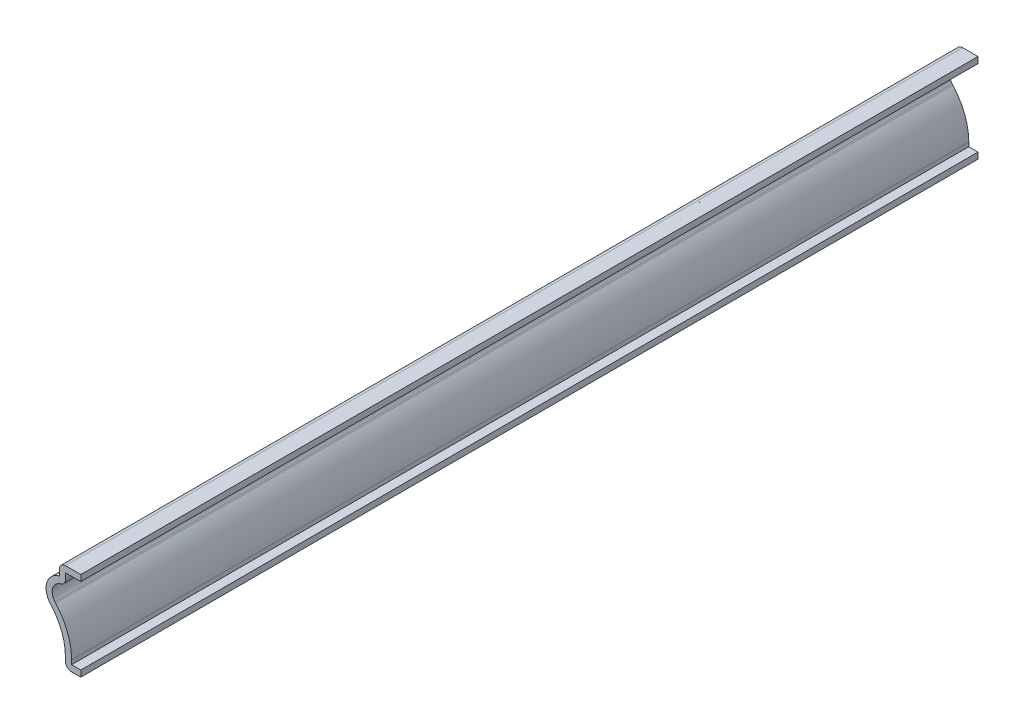
ISO-10303-21;
HEADER;
FILE_DESCRIPTION(('STEP AP214'),'2;1');
FILE_NAME('part.step','',(''),(''),'','','');
FILE_SCHEMA(('AUTOMOTIVE_DESIGN { 1 0 10303 214 1 1 1 1 }'));
ENDSEC;
DATA;
#1=APPLICATION_CONTEXT('core data for automotive mechanical design processes');
#2=APPLICATION_PROTOCOL_DEFINITION('international standard','automotive_design',2000,#1);
#3=PRODUCT_CONTEXT('',#1,'mechanical');
#4=PRODUCT('Part','Part','',(#3));
#5=PRODUCT_RELATED_PRODUCT_CATEGORY('part','',(#4));
#6=PRODUCT_DEFINITION_FORMATION('','',#4);
#7=PRODUCT_DEFINITION_CONTEXT('part definition',#1,'design');
#8=PRODUCT_DEFINITION('design','',#6,#7);
#9=PRODUCT_DEFINITION_SHAPE('','',#8);
#10=(LENGTH_UNIT() NAMED_UNIT(*) SI_UNIT(.MILLI.,.METRE.));
#11=(NAMED_UNIT(*) PLANE_ANGLE_UNIT() SI_UNIT($,.RADIAN.));
#12=(NAMED_UNIT(*) SI_UNIT($,.STERADIAN.) SOLID_ANGLE_UNIT());
#13=UNCERTAINTY_MEASURE_WITH_UNIT(LENGTH_MEASURE(1.E-05),#10,'distance_accuracy_value','');
#14=(GEOMETRIC_REPRESENTATION_CONTEXT(3) GLOBAL_UNCERTAINTY_ASSIGNED_CONTEXT((#13)) GLOBAL_UNIT_ASSIGNED_CONTEXT((#10,
#11,#12)) REPRESENTATION_CONTEXT('',''));
#15=CARTESIAN_POINT('',(0.,0.,0.));
#16=DIRECTION('',(0.,0.,1.));
#17=DIRECTION('',(1.,0.,0.));
#18=AXIS2_PLACEMENT_3D('',#15,#16,#17);
#19=CARTESIAN_POINT('',(0.,0.,-184.15));
#20=DIRECTION('',(0.,-1.,0.));
#21=DIRECTION('',(0.,0.,-1.));
#22=AXIS2_PLACEMENT_3D('',#19,#20,#21);
#23=PLANE('',#22);
#24=DIRECTION('',(1.,0.,0.));
#25=VECTOR('',#24,1.);
#26=CARTESIAN_POINT('',(0.,0.,0.));
#27=LINE('',#26,#25);
#28=CARTESIAN_POINT('',(-1.8937161979954,0.,0.));
#29=VERTEX_POINT('',#28);
#30=CARTESIAN_POINT('',(0.,0.,0.));
#31=VERTEX_POINT('',#30);
#32=EDGE_CURVE('E293',#29,#31,#27,.T.);
#33=ORIENTED_EDGE('',*,*,#32,.F.);
#34=DIRECTION('',(0.,0.,1.));
#35=VECTOR('',#34,1.);
#36=CARTESIAN_POINT('',(-1.8937161979954,0.,-184.15));
#37=LINE('',#36,#35);
#38=CARTESIAN_POINT('',(-1.8937161979954,0.,-184.15));
#39=VERTEX_POINT('',#38);
#40=EDGE_CURVE('E174',#29,#39,#37,.F.);
#41=ORIENTED_EDGE('',*,*,#40,.T.);
#42=DIRECTION('',(1.,0.,0.));
#43=VECTOR('',#42,1.);
#44=CARTESIAN_POINT('',(0.,0.,-184.15));
#45=LINE('',#44,#43);
#46=CARTESIAN_POINT('',(0.,0.,-184.15));
#47=VERTEX_POINT('',#46);
#48=EDGE_CURVE('E167',#39,#47,#45,.T.);
#49=ORIENTED_EDGE('',*,*,#48,.T.);
#50=DIRECTION('',(0.,0.,1.));
#51=VECTOR('',#50,1.);
#52=CARTESIAN_POINT('',(0.,0.,-184.15));
#53=LINE('',#52,#51);
#54=EDGE_CURVE('E171',#47,#31,#53,.T.);
#55=ORIENTED_EDGE('',*,*,#54,.T.);
#56=EDGE_LOOP('',(#33,#41,#49,#55));
#57=FACE_BOUND('',#56,.T.);
#58=ADVANCED_FACE('F35',(#57),#23,.T.);
#59=CARTESIAN_POINT('',(-3.1637161979954,0.,-184.15));
#60=DIRECTION('',(-1.,0.,0.));
#61=DIRECTION('',(0.,0.,1.));
#62=AXIS2_PLACEMENT_3D('',#59,#60,#61);
#63=PLANE('',#62);
#64=DIRECTION('',(0.,-1.,0.));
#65=VECTOR('',#64,1.);
#66=CARTESIAN_POINT('',(-3.1637161979954,0.,-184.15));
#67=LINE('',#66,#65);
#68=CARTESIAN_POINT('',(-3.1637161979954,2.11946373835883,-184.15));
#69=VERTEX_POINT('',#68);
#70=CARTESIAN_POINT('',(-3.1637161979954,1.27,-184.15));
#71=VERTEX_POINT('',#70);
#72=EDGE_CURVE('E191',#69,#71,#67,.T.);
#73=ORIENTED_EDGE('',*,*,#72,.T.);
#74=DIRECTION('',(0.,0.,1.));
#75=VECTOR('',#74,1.);
#76=CARTESIAN_POINT('',(-3.1637161979954,1.27,-184.15));
#77=LINE('',#76,#75);
#78=CARTESIAN_POINT('',(-3.1637161979954,1.27,0.));
#79=VERTEX_POINT('',#78);
#80=EDGE_CURVE('E200',#71,#79,#77,.T.);
#81=ORIENTED_EDGE('',*,*,#80,.T.);
#82=DIRECTION('',(0.,-1.,0.));
#83=VECTOR('',#82,1.);
#84=CARTESIAN_POINT('',(-3.1637161979954,0.,0.));
#85=LINE('',#84,#83);
#86=CARTESIAN_POINT('',(-3.1637161979954,2.11946373835883,0.));
#87=VERTEX_POINT('',#86);
#88=EDGE_CURVE('E177',#87,#79,#85,.T.);
#89=ORIENTED_EDGE('',*,*,#88,.F.);
#90=DIRECTION('',(0.,0.,1.));
#91=VECTOR('',#90,1.);
#92=CARTESIAN_POINT('',(-3.1637161979954,2.11946373835883,-184.15));
#93=LINE('',#92,#91);
#94=EDGE_CURVE('E204',#69,#87,#93,.T.);
#95=ORIENTED_EDGE('',*,*,#94,.F.);
#96=EDGE_LOOP('',(#73,#81,#89,#95));
#97=FACE_BOUND('',#96,.T.);
#98=ADVANCED_FACE('F348',(#97),#63,.T.);
#99=CARTESIAN_POINT('',(-14.4820004486888,2.11946373835883,-184.15));
#100=DIRECTION('',(0.,0.,1.));
#101=DIRECTION('',(1.,0.,0.));
#102=AXIS2_PLACEMENT_3D('',#99,#100,#101);
#103=CYLINDRICAL_SURFACE('',#102,11.3182842506934);
#104=CARTESIAN_POINT('',(-14.4820004486888,2.11946373835883,0.));
#105=DIRECTION('',(0.,0.,-1.));
#106=DIRECTION('',(1.,0.,0.));
#107=AXIS2_PLACEMENT_3D('',#104,#105,#106);
#108=CIRCLE('',#107,11.3182842506934);
#109=CARTESIAN_POINT('',(-6.10098703850431,9.72618264980824,0.));
#110=VERTEX_POINT('',#109);
#111=EDGE_CURVE('E251',#110,#87,#108,.T.);
#112=ORIENTED_EDGE('',*,*,#111,.F.);
#113=DIRECTION('',(0.,0.,1.));
#114=VECTOR('',#113,1.);
#115=CARTESIAN_POINT('',(-6.10098703850431,9.72618264980824,-184.15));
#116=LINE('',#115,#114);
#117=CARTESIAN_POINT('',(-6.10098703850431,9.72618264980824,-184.15));
#118=VERTEX_POINT('',#117);
#119=EDGE_CURVE('E256',#118,#110,#116,.T.);
#120=ORIENTED_EDGE('',*,*,#119,.F.);
#121=CARTESIAN_POINT('',(-14.4820004486888,2.11946373835883,-184.15));
#122=DIRECTION('',(0.,0.,-1.));
#123=DIRECTION('',(1.,0.,0.));
#124=AXIS2_PLACEMENT_3D('',#121,#122,#123);
#125=CIRCLE('',#124,11.3182842506934);
#126=EDGE_CURVE('E196',#118,#69,#125,.T.);
#127=ORIENTED_EDGE('',*,*,#126,.T.);
#128=ORIENTED_EDGE('',*,*,#94,.T.);
#129=EDGE_LOOP('',(#112,#120,#127,#128));
#130=FACE_BOUND('',#129,.T.);
#131=ADVANCED_FACE('F352',(#130),#103,.F.);
#132=CARTESIAN_POINT('',(0.169374969325012,15.4172463591955,-184.15));
#133=DIRECTION('',(0.,0.,1.));
#134=DIRECTION('',(1.,0.,0.));
#135=AXIS2_PLACEMENT_3D('',#132,#133,#134);
#136=CYLINDRICAL_SURFACE('',#135,8.46791862582148);
#137=CARTESIAN_POINT('',(0.169374969325012,15.4172463591955,0.));
#138=DIRECTION('',(0.,0.,1.));
#139=DIRECTION('',(-1.,0.,0.));
#140=AXIS2_PLACEMENT_3D('',#137,#138,#139);
#141=CIRCLE('',#140,8.46791862582148);
#142=CARTESIAN_POINT('',(-6.28465386178025,9.93535273556543,0.));
#143=VERTEX_POINT('',#142);
#144=EDGE_CURVE('E248',#143,#110,#141,.T.);
#145=ORIENTED_EDGE('',*,*,#144,.F.);
#146=DIRECTION('',(0.,0.,1.));
#147=VECTOR('',#146,1.);
#148=CARTESIAN_POINT('',(-6.28465386178025,9.93535273556543,-184.15));
#149=LINE('',#148,#147);
#150=CARTESIAN_POINT('',(-6.28465386178025,9.93535273556543,-184.15));
#151=VERTEX_POINT('',#150);
#152=EDGE_CURVE('E258',#151,#143,#149,.T.);
#153=ORIENTED_EDGE('',*,*,#152,.F.);
#154=CARTESIAN_POINT('',(0.169374969325012,15.4172463591955,-184.15));
#155=DIRECTION('',(0.,0.,1.));
#156=DIRECTION('',(-1.,0.,0.));
#157=AXIS2_PLACEMENT_3D('',#154,#155,#156);
#158=CIRCLE('',#157,8.46791862582148);
#159=EDGE_CURVE('E338',#151,#118,#158,.T.);
#160=ORIENTED_EDGE('',*,*,#159,.T.);
#161=ORIENTED_EDGE('',*,*,#119,.T.);
#162=EDGE_LOOP('',(#145,#153,#160,#161));
#163=FACE_BOUND('',#162,.T.);
#164=ADVANCED_FACE('F357',(#163),#136,.T.);
#165=CARTESIAN_POINT('',(-3.53145889584482,12.2738489405455,-184.15));
#166=DIRECTION('',(0.,0.,1.));
#167=DIRECTION('',(1.,0.,0.));
#168=AXIS2_PLACEMENT_3D('',#165,#166,#167);
#169=CYLINDRICAL_SURFACE('',#168,3.61229110415518);
#170=CARTESIAN_POINT('',(-3.53145889584482,12.2738489405455,0.));
#171=DIRECTION('',(0.,0.,1.));
#172=DIRECTION('',(-1.,0.,0.));
#173=AXIS2_PLACEMENT_3D('',#170,#171,#172);
#174=CIRCLE('',#173,3.61229110415518);
#175=CARTESIAN_POINT('',(-4.42180822824157,15.7746952792841,0.));
#176=VERTEX_POINT('',#175);
#177=EDGE_CURVE('E240',#176,#143,#174,.T.);
#178=ORIENTED_EDGE('',*,*,#177,.F.);
#179=DIRECTION('',(0.,0.,1.));
#180=VECTOR('',#179,1.);
#181=CARTESIAN_POINT('',(-4.42180822824157,15.7746952792841,-184.15));
#182=LINE('',#181,#180);
#183=CARTESIAN_POINT('',(-4.42180822824157,15.7746952792841,-184.15));
#184=VERTEX_POINT('',#183);
#185=EDGE_CURVE('E260',#184,#176,#182,.T.);
#186=ORIENTED_EDGE('',*,*,#185,.F.);
#187=CARTESIAN_POINT('',(-3.53145889584482,12.2738489405455,-184.15));
#188=DIRECTION('',(0.,0.,1.));
#189=DIRECTION('',(-1.,0.,0.));
#190=AXIS2_PLACEMENT_3D('',#187,#188,#189);
#191=CIRCLE('',#190,3.61229110415518);
#192=EDGE_CURVE('E335',#184,#151,#191,.T.);
#193=ORIENTED_EDGE('',*,*,#192,.T.);
#194=ORIENTED_EDGE('',*,*,#152,.T.);
#195=EDGE_LOOP('',(#178,#186,#193,#194));
#196=FACE_BOUND('',#195,.T.);
#197=ADVANCED_FACE('F360',(#196),#169,.T.);
#198=CARTESIAN_POINT('',(-4.42180822824158,18.25625,-184.15));
#199=DIRECTION('',(-1.,0.,0.));
#200=DIRECTION('',(0.,-1.,0.));
#201=AXIS2_PLACEMENT_3D('',#198,#199,#200);
#202=PLANE('',#201);
#203=DIRECTION('',(0.,-1.,0.));
#204=VECTOR('',#203,1.);
#205=CARTESIAN_POINT('',(-4.42180822824158,18.25625,0.));
#206=LINE('',#205,#204);
#207=CARTESIAN_POINT('',(-4.42180822824157,16.98625,0.));
#208=VERTEX_POINT('',#207);
#209=EDGE_CURVE('E238',#208,#176,#206,.T.);
#210=ORIENTED_EDGE('',*,*,#209,.F.);
#211=DIRECTION('',(0.,0.,1.));
#212=VECTOR('',#211,1.);
#213=CARTESIAN_POINT('',(-4.42180822824157,16.98625,-184.15));
#214=LINE('',#213,#212);
#215=CARTESIAN_POINT('',(-4.42180822824157,16.98625,-184.15));
#216=VERTEX_POINT('',#215);
#217=EDGE_CURVE('E11',#208,#216,#214,.F.);
#218=ORIENTED_EDGE('',*,*,#217,.T.);
#219=DIRECTION('',(0.,-1.,0.));
#220=VECTOR('',#219,1.);
#221=CARTESIAN_POINT('',(-4.42180822824158,18.25625,-184.15));
#222=LINE('',#221,#220);
#223=EDGE_CURVE('E333',#216,#184,#222,.T.);
#224=ORIENTED_EDGE('',*,*,#223,.T.);
#225=ORIENTED_EDGE('',*,*,#185,.T.);
#226=EDGE_LOOP('',(#210,#218,#224,#225));
#227=FACE_BOUND('',#226,.T.);
#228=ADVANCED_FACE('F365',(#227),#202,.T.);
#229=CARTESIAN_POINT('',(0.,18.25625,-184.15));
#230=DIRECTION('',(0.,1.,0.));
#231=DIRECTION('',(0.,0.,1.));
#232=AXIS2_PLACEMENT_3D('',#229,#230,#231);
#233=PLANE('',#232);
#234=DIRECTION('',(-1.,0.,0.));
#235=VECTOR('',#234,1.);
#236=CARTESIAN_POINT('',(0.,18.25625,-184.15));
#237=LINE('',#236,#235);
#238=CARTESIAN_POINT('',(0.,18.25625,-184.15));
#239=VERTEX_POINT('',#238);
#240=CARTESIAN_POINT('',(-3.15180822824157,18.25625,-184.15));
#241=VERTEX_POINT('',#240);
#242=EDGE_CURVE('E228',#239,#241,#237,.T.);
#243=ORIENTED_EDGE('',*,*,#242,.T.);
#244=DIRECTION('',(0.,0.,1.));
#245=VECTOR('',#244,1.);
#246=CARTESIAN_POINT('',(-3.15180822824157,18.25625,-184.15));
#247=LINE('',#246,#245);
#248=CARTESIAN_POINT('',(-3.15180822824157,18.25625,0.));
#249=VERTEX_POINT('',#248);
#250=EDGE_CURVE('E43',#241,#249,#247,.T.);
#251=ORIENTED_EDGE('',*,*,#250,.T.);
#252=DIRECTION('',(-1.,0.,0.));
#253=VECTOR('',#252,1.);
#254=CARTESIAN_POINT('',(0.,18.25625,0.));
#255=LINE('',#254,#253);
#256=CARTESIAN_POINT('',(0.,18.25625,0.));
#257=VERTEX_POINT('',#256);
#258=EDGE_CURVE('E226',#257,#249,#255,.T.);
#259=ORIENTED_EDGE('',*,*,#258,.F.);
#260=DIRECTION('',(0.,0.,1.));
#261=VECTOR('',#260,1.);
#262=CARTESIAN_POINT('',(0.,18.25625,-184.15));
#263=LINE('',#262,#261);
#264=EDGE_CURVE('E263',#239,#257,#263,.T.);
#265=ORIENTED_EDGE('',*,*,#264,.F.);
#266=EDGE_LOOP('',(#243,#251,#259,#265));
#267=FACE_BOUND('',#266,.T.);
#268=ADVANCED_FACE('F225',(#267),#233,.T.);
#269=CARTESIAN_POINT('',(0.,18.25625,-184.15));
#270=DIRECTION('',(-1.,0.,0.));
#271=DIRECTION('',(0.,0.,1.));
#272=AXIS2_PLACEMENT_3D('',#269,#270,#271);
#273=PLANE('',#272);
#274=DIRECTION('',(0.,-1.,0.));
#275=VECTOR('',#274,1.);
#276=CARTESIAN_POINT('',(0.,18.25625,0.));
#277=LINE('',#276,#275);
#278=CARTESIAN_POINT('',(0.,16.98625,0.));
#279=VERTEX_POINT('',#278);
#280=EDGE_CURVE('E237',#257,#279,#277,.T.);
#281=ORIENTED_EDGE('',*,*,#280,.T.);
#282=DIRECTION('',(0.,0.,1.));
#283=VECTOR('',#282,1.);
#284=CARTESIAN_POINT('',(0.,16.98625,-184.15));
#285=LINE('',#284,#283);
#286=CARTESIAN_POINT('',(0.,16.98625,-184.15));
#287=VERTEX_POINT('',#286);
#288=EDGE_CURVE('E265',#287,#279,#285,.T.);
#289=ORIENTED_EDGE('',*,*,#288,.F.);
#290=DIRECTION('',(0.,-1.,0.));
#291=VECTOR('',#290,1.);
#292=CARTESIAN_POINT('',(0.,18.25625,-184.15));
#293=LINE('',#292,#291);
#294=EDGE_CURVE('E330',#239,#287,#293,.T.);
#295=ORIENTED_EDGE('',*,*,#294,.F.);
#296=ORIENTED_EDGE('',*,*,#264,.T.);
#297=EDGE_LOOP('',(#281,#289,#295,#296));
#298=FACE_BOUND('',#297,.T.);
#299=ADVANCED_FACE('F372',(#298),#273,.F.);
#300=CARTESIAN_POINT('',(0.,16.98625,-184.15));
#301=DIRECTION('',(0.,1.,0.));
#302=DIRECTION('',(0.,0.,1.));
#303=AXIS2_PLACEMENT_3D('',#300,#301,#302);
#304=PLANE('',#303);
#305=DIRECTION('',(1.,0.,0.));
#306=VECTOR('',#305,1.);
#307=CARTESIAN_POINT('',(0.,16.98625,0.));
#308=LINE('',#307,#306);
#309=CARTESIAN_POINT('',(-3.15180822824157,16.98625,0.));
#310=VERTEX_POINT('',#309);
#311=EDGE_CURVE('E242',#279,#310,#308,.F.);
#312=ORIENTED_EDGE('',*,*,#311,.T.);
#313=DIRECTION('',(0.,0.,1.));
#314=VECTOR('',#313,1.);
#315=CARTESIAN_POINT('',(-3.15180822824157,16.98625,-184.15));
#316=LINE('',#315,#314);
#317=CARTESIAN_POINT('',(-3.15180822824157,16.98625,-184.15));
#318=VERTEX_POINT('',#317);
#319=EDGE_CURVE('E268',#318,#310,#316,.T.);
#320=ORIENTED_EDGE('',*,*,#319,.F.);
#321=DIRECTION('',(1.,0.,0.));
#322=VECTOR('',#321,1.);
#323=CARTESIAN_POINT('',(0.,16.98625,-184.15));
#324=LINE('',#323,#322);
#325=EDGE_CURVE('E323',#287,#318,#324,.F.);
#326=ORIENTED_EDGE('',*,*,#325,.F.);
#327=ORIENTED_EDGE('',*,*,#288,.T.);
#328=EDGE_LOOP('',(#312,#320,#326,#327));
#329=FACE_BOUND('',#328,.T.);
#330=ADVANCED_FACE('F305',(#329),#304,.F.);
#331=CARTESIAN_POINT('',(-3.15180822824157,18.25625,-184.15));
#332=DIRECTION('',(-1.,0.,0.));
#333=DIRECTION('',(0.,-1.,0.));
#334=AXIS2_PLACEMENT_3D('',#331,#332,#333);
#335=PLANE('',#334);
#336=DIRECTION('',(0.,-1.,0.));
#337=VECTOR('',#336,1.);
#338=CARTESIAN_POINT('',(-3.15180822824157,18.25625,0.));
#339=LINE('',#338,#337);
#340=CARTESIAN_POINT('',(-3.15180822824157,15.7746952792841,0.));
#341=VERTEX_POINT('',#340);
#342=EDGE_CURVE('E302',#310,#341,#339,.T.);
#343=ORIENTED_EDGE('',*,*,#342,.T.);
#344=DIRECTION('',(0.,0.,1.));
#345=VECTOR('',#344,1.);
#346=CARTESIAN_POINT('',(-3.15180822824157,15.7746952792841,-184.15));
#347=LINE('',#346,#345);
#348=CARTESIAN_POINT('',(-3.15180822824157,15.7746952792841,-184.15));
#349=VERTEX_POINT('',#348);
#350=EDGE_CURVE('E58',#341,#349,#347,.F.);
#351=ORIENTED_EDGE('',*,*,#350,.T.);
#352=DIRECTION('',(0.,-1.,0.));
#353=VECTOR('',#352,1.);
#354=CARTESIAN_POINT('',(-3.15180822824157,18.25625,-184.15));
#355=LINE('',#354,#353);
#356=EDGE_CURVE('E310',#318,#349,#355,.T.);
#357=ORIENTED_EDGE('',*,*,#356,.F.);
#358=ORIENTED_EDGE('',*,*,#319,.T.);
#359=EDGE_LOOP('',(#343,#351,#357,#358));
#360=FACE_BOUND('',#359,.T.);
#361=ADVANCED_FACE('F309',(#360),#335,.F.);
#362=CARTESIAN_POINT('',(-3.53145889584482,12.2738489405455,-184.15));
#363=DIRECTION('',(0.,0.,1.));
#364=DIRECTION('',(1.,0.,0.));
#365=AXIS2_PLACEMENT_3D('',#362,#363,#364);
#366=CYLINDRICAL_SURFACE('',#365,2.34229110415518);
#367=CARTESIAN_POINT('',(-3.53145889584482,12.2738489405455,-184.15));
#368=DIRECTION('',(0.,0.,1.));
#369=DIRECTION('',(1.,0.,0.));
#370=AXIS2_PLACEMENT_3D('',#367,#368,#369);
#371=CIRCLE('',#370,2.34229110415518);
#372=CARTESIAN_POINT('',(-4.10878150377765,14.5438767427925,-184.15));
#373=VERTEX_POINT('',#372);
#374=CARTESIAN_POINT('',(-5.31669266875349,10.7575152066101,-184.15));
#375=VERTEX_POINT('',#374);
#376=EDGE_CURVE('E319',#373,#375,#371,.T.);
#377=ORIENTED_EDGE('',*,*,#376,.F.);
#378=DIRECTION('',(0.,0.,1.));
#379=VECTOR('',#378,1.);
#380=CARTESIAN_POINT('',(-4.10878150377765,14.5438767427925,-184.15));
#381=LINE('',#380,#379);
#382=CARTESIAN_POINT('',(-4.10878150377765,14.5438767427925,0.));
#383=VERTEX_POINT('',#382);
#384=EDGE_CURVE('E216',#373,#383,#381,.T.);
#385=ORIENTED_EDGE('',*,*,#384,.T.);
#386=CARTESIAN_POINT('',(-3.53145889584482,12.2738489405455,0.));
#387=DIRECTION('',(0.,0.,1.));
#388=DIRECTION('',(1.,0.,0.));
#389=AXIS2_PLACEMENT_3D('',#386,#387,#388);
#390=CIRCLE('',#389,2.34229110415518);
#391=CARTESIAN_POINT('',(-5.31669266875349,10.7575152066101,0.));
#392=VERTEX_POINT('',#391);
#393=EDGE_CURVE('E300',#383,#392,#390,.T.);
#394=ORIENTED_EDGE('',*,*,#393,.T.);
#395=DIRECTION('',(0.,0.,1.));
#396=VECTOR('',#395,1.);
#397=CARTESIAN_POINT('',(-5.31669266875349,10.7575152066101,-184.15));
#398=LINE('',#397,#396);
#399=EDGE_CURVE('E271',#375,#392,#398,.T.);
#400=ORIENTED_EDGE('',*,*,#399,.F.);
#401=EDGE_LOOP('',(#377,#385,#394,#400));
#402=FACE_BOUND('',#401,.T.);
#403=ADVANCED_FACE('F317',(#402),#366,.F.);
#404=CARTESIAN_POINT('',(0.169374969325012,15.4172463591955,-184.15));
#405=DIRECTION('',(0.,0.,1.));
#406=DIRECTION('',(1.,0.,0.));
#407=AXIS2_PLACEMENT_3D('',#404,#405,#406);
#408=CYLINDRICAL_SURFACE('',#407,7.19791862582148);
#409=CARTESIAN_POINT('',(0.169374969325012,15.4172463591955,0.));
#410=DIRECTION('',(0.,0.,1.));
#411=DIRECTION('',(1.,0.,0.));
#412=AXIS2_PLACEMENT_3D('',#409,#410,#411);
#413=CIRCLE('',#412,7.19791862582148);
#414=CARTESIAN_POINT('',(-5.16057179577154,10.5797159949307,0.));
#415=VERTEX_POINT('',#414);
#416=EDGE_CURVE('E298',#392,#415,#413,.T.);
#417=ORIENTED_EDGE('',*,*,#416,.T.);
#418=DIRECTION('',(0.,0.,1.));
#419=VECTOR('',#418,1.);
#420=CARTESIAN_POINT('',(-5.16057179577154,10.5797159949307,-184.15));
#421=LINE('',#420,#419);
#422=CARTESIAN_POINT('',(-5.16057179577154,10.5797159949307,-184.15));
#423=VERTEX_POINT('',#422);
#424=EDGE_CURVE('E274',#423,#415,#421,.T.);
#425=ORIENTED_EDGE('',*,*,#424,.F.);
#426=CARTESIAN_POINT('',(0.169374969325012,15.4172463591955,-184.15));
#427=DIRECTION('',(0.,0.,1.));
#428=DIRECTION('',(1.,0.,0.));
#429=AXIS2_PLACEMENT_3D('',#426,#427,#428);
#430=CIRCLE('',#429,7.19791862582148);
#431=EDGE_CURVE('E321',#375,#423,#430,.T.);
#432=ORIENTED_EDGE('',*,*,#431,.F.);
#433=ORIENTED_EDGE('',*,*,#399,.T.);
#434=EDGE_LOOP('',(#417,#425,#432,#433));
#435=FACE_BOUND('',#434,.T.);
#436=ADVANCED_FACE('F429',(#435),#408,.F.);
#437=CARTESIAN_POINT('',(-14.4820004486888,2.11946373835883,-184.15));
#438=DIRECTION('',(0.,0.,1.));
#439=DIRECTION('',(1.,0.,0.));
#440=AXIS2_PLACEMENT_3D('',#437,#438,#439);
#441=CYLINDRICAL_SURFACE('',#440,12.5882842506934);
#442=CARTESIAN_POINT('',(-14.4820004486888,2.11946373835883,0.));
#443=DIRECTION('',(0.,0.,1.));
#444=DIRECTION('',(1.,0.,0.));
#445=AXIS2_PLACEMENT_3D('',#442,#443,#444);
#446=CIRCLE('',#445,12.5882842506934);
#447=CARTESIAN_POINT('',(-1.8937161979954,2.11946373835883,0.));
#448=VERTEX_POINT('',#447);
#449=EDGE_CURVE('E291',#415,#448,#446,.F.);
#450=ORIENTED_EDGE('',*,*,#449,.T.);
#451=DIRECTION('',(0.,0.,1.));
#452=VECTOR('',#451,1.);
#453=CARTESIAN_POINT('',(-1.8937161979954,2.11946373835883,-184.15));
#454=LINE('',#453,#452);
#455=CARTESIAN_POINT('',(-1.8937161979954,2.11946373835883,-184.15));
#456=VERTEX_POINT('',#455);
#457=EDGE_CURVE('E277',#456,#448,#454,.T.);
#458=ORIENTED_EDGE('',*,*,#457,.F.);
#459=CARTESIAN_POINT('',(-14.4820004486888,2.11946373835883,-184.15));
#460=DIRECTION('',(0.,0.,1.));
#461=DIRECTION('',(1.,0.,0.));
#462=AXIS2_PLACEMENT_3D('',#459,#460,#461);
#463=CIRCLE('',#462,12.5882842506934);
#464=EDGE_CURVE('E325',#423,#456,#463,.F.);
#465=ORIENTED_EDGE('',*,*,#464,.F.);
#466=ORIENTED_EDGE('',*,*,#424,.T.);
#467=EDGE_LOOP('',(#450,#458,#465,#466));
#468=FACE_BOUND('',#467,.T.);
#469=ADVANCED_FACE('F488',(#468),#441,.T.);
#470=CARTESIAN_POINT('',(-1.8937161979954,0.,-184.15));
#471=DIRECTION('',(-1.,0.,0.));
#472=DIRECTION('',(0.,0.,1.));
#473=AXIS2_PLACEMENT_3D('',#470,#471,#472);
#474=PLANE('',#473);
#475=DIRECTION('',(0.,1.,0.));
#476=VECTOR('',#475,1.);
#477=CARTESIAN_POINT('',(-1.8937161979954,0.,0.));
#478=LINE('',#477,#476);
#479=CARTESIAN_POINT('',(-1.8937161979954,1.27,0.));
#480=VERTEX_POINT('',#479);
#481=EDGE_CURVE('E289',#448,#480,#478,.F.);
#482=ORIENTED_EDGE('',*,*,#481,.T.);
#483=DIRECTION('',(0.,0.,1.));
#484=VECTOR('',#483,1.);
#485=CARTESIAN_POINT('',(-1.8937161979954,1.27,-184.15));
#486=LINE('',#485,#484);
#487=CARTESIAN_POINT('',(-1.8937161979954,1.27,-184.15));
#488=VERTEX_POINT('',#487);
#489=EDGE_CURVE('E193',#488,#480,#486,.T.);
#490=ORIENTED_EDGE('',*,*,#489,.F.);
#491=DIRECTION('',(0.,1.,0.));
#492=VECTOR('',#491,1.);
#493=CARTESIAN_POINT('',(-1.8937161979954,0.,-184.15));
#494=LINE('',#493,#492);
#495=EDGE_CURVE('E544',#456,#488,#494,.F.);
#496=ORIENTED_EDGE('',*,*,#495,.F.);
#497=ORIENTED_EDGE('',*,*,#457,.T.);
#498=EDGE_LOOP('',(#482,#490,#496,#497));
#499=FACE_BOUND('',#498,.T.);
#500=ADVANCED_FACE('F480',(#499),#474,.F.);
#501=CARTESIAN_POINT('',(0.,1.27,-184.15));
#502=DIRECTION('',(0.,-1.,0.));
#503=DIRECTION('',(0.,0.,-1.));
#504=AXIS2_PLACEMENT_3D('',#501,#502,#503);
#505=PLANE('',#504);
#506=DIRECTION('',(1.,0.,0.));
#507=VECTOR('',#506,1.);
#508=CARTESIAN_POINT('',(0.,1.27,0.));
#509=LINE('',#508,#507);
#510=CARTESIAN_POINT('',(0.,1.27,0.));
#511=VERTEX_POINT('',#510);
#512=EDGE_CURVE('E284',#480,#511,#509,.T.);
#513=ORIENTED_EDGE('',*,*,#512,.T.);
#514=DIRECTION('',(0.,0.,1.));
#515=VECTOR('',#514,1.);
#516=CARTESIAN_POINT('',(0.,1.27,-184.15));
#517=LINE('',#516,#515);
#518=CARTESIAN_POINT('',(0.,1.27,-184.15));
#519=VERTEX_POINT('',#518);
#520=EDGE_CURVE('E190',#519,#511,#517,.T.);
#521=ORIENTED_EDGE('',*,*,#520,.F.);
#522=DIRECTION('',(1.,0.,0.));
#523=VECTOR('',#522,1.);
#524=CARTESIAN_POINT('',(0.,1.27,-184.15));
#525=LINE('',#524,#523);
#526=EDGE_CURVE('E182',#488,#519,#525,.T.);
#527=ORIENTED_EDGE('',*,*,#526,.F.);
#528=ORIENTED_EDGE('',*,*,#489,.T.);
#529=EDGE_LOOP('',(#513,#521,#527,#528));
#530=FACE_BOUND('',#529,.T.);
#531=ADVANCED_FACE('F283',(#530),#505,.F.);
#532=CARTESIAN_POINT('',(0.,1.27,-184.15));
#533=DIRECTION('',(-1.,0.,0.));
#534=DIRECTION('',(0.,0.,1.));
#535=AXIS2_PLACEMENT_3D('',#532,#533,#534);
#536=PLANE('',#535);
#537=DIRECTION('',(0.,-1.,0.));
#538=VECTOR('',#537,1.);
#539=CARTESIAN_POINT('',(0.,1.27,0.));
#540=LINE('',#539,#538);
#541=EDGE_CURVE('E189',#511,#31,#540,.T.);
#542=ORIENTED_EDGE('',*,*,#541,.T.);
#543=ORIENTED_EDGE('',*,*,#54,.F.);
#544=DIRECTION('',(0.,-1.,0.));
#545=VECTOR('',#544,1.);
#546=CARTESIAN_POINT('',(0.,1.27,-184.15));
#547=LINE('',#546,#545);
#548=EDGE_CURVE('E176',#519,#47,#547,.T.);
#549=ORIENTED_EDGE('',*,*,#548,.F.);
#550=ORIENTED_EDGE('',*,*,#520,.T.);
#551=EDGE_LOOP('',(#542,#543,#549,#550));
#552=FACE_BOUND('',#551,.T.);
#553=ADVANCED_FACE('F187',(#552),#536,.F.);
#554=CARTESIAN_POINT('',(-14.4820004486888,2.11946373835883,-184.15));
#555=DIRECTION('',(0.,0.,1.));
#556=DIRECTION('',(1.,0.,0.));
#557=AXIS2_PLACEMENT_3D('',#554,#555,#556);
#558=PLANE('',#557);
#559=ORIENTED_EDGE('',*,*,#48,.F.);
#560=CARTESIAN_POINT('',(-1.8937161979954,1.27,-184.15));
#561=DIRECTION('',(0.,0.,1.));
#562=DIRECTION('',(1.,0.,0.));
#563=AXIS2_PLACEMENT_3D('',#560,#561,#562);
#564=CIRCLE('',#563,1.27);
#565=EDGE_CURVE('E214',#39,#71,#564,.F.);
#566=ORIENTED_EDGE('',*,*,#565,.T.);
#567=ORIENTED_EDGE('',*,*,#72,.F.);
#568=ORIENTED_EDGE('',*,*,#126,.F.);
#569=ORIENTED_EDGE('',*,*,#159,.F.);
#570=ORIENTED_EDGE('',*,*,#192,.F.);
#571=ORIENTED_EDGE('',*,*,#223,.F.);
#572=CARTESIAN_POINT('',(-3.15180822824157,16.98625,-184.15));
#573=DIRECTION('',(0.,0.,1.));
#574=DIRECTION('',(1.,0.,0.));
#575=AXIS2_PLACEMENT_3D('',#572,#573,#574);
#576=CIRCLE('',#575,1.27);
#577=EDGE_CURVE('E211',#216,#241,#576,.F.);
#578=ORIENTED_EDGE('',*,*,#577,.T.);
#579=ORIENTED_EDGE('',*,*,#242,.F.);
#580=ORIENTED_EDGE('',*,*,#294,.T.);
#581=ORIENTED_EDGE('',*,*,#325,.T.);
#582=ORIENTED_EDGE('',*,*,#356,.T.);
#583=CARTESIAN_POINT('',(-4.42180822824157,15.7746952792841,-184.15));
#584=DIRECTION('',(0.,0.,1.));
#585=DIRECTION('',(1.,0.,0.));
#586=AXIS2_PLACEMENT_3D('',#583,#584,#585);
#587=CIRCLE('',#586,1.27);
#588=EDGE_CURVE('E50',#349,#373,#587,.F.);
#589=ORIENTED_EDGE('',*,*,#588,.T.);
#590=ORIENTED_EDGE('',*,*,#376,.T.);
#591=ORIENTED_EDGE('',*,*,#431,.T.);
#592=ORIENTED_EDGE('',*,*,#464,.T.);
#593=ORIENTED_EDGE('',*,*,#495,.T.);
#594=ORIENTED_EDGE('',*,*,#526,.T.);
#595=ORIENTED_EDGE('',*,*,#548,.T.);
#596=EDGE_LOOP('',(#559,#566,#567,#568,#569,#570,#571,#578,#579,#580,#581,#582,#589,#590,#591,
#592,#593,#594,#595));
#597=FACE_BOUND('',#596,.T.);
#598=ADVANCED_FACE('F180',(#597),#558,.F.);
#599=CARTESIAN_POINT('',(-14.4820004486888,2.11946373835883,0.));
#600=DIRECTION('',(0.,0.,1.));
#601=DIRECTION('',(1.,0.,0.));
#602=AXIS2_PLACEMENT_3D('',#599,#600,#601);
#603=PLANE('',#602);
#604=ORIENTED_EDGE('',*,*,#88,.T.);
#605=CARTESIAN_POINT('',(-1.8937161979954,1.27,0.));
#606=DIRECTION('',(0.,0.,1.));
#607=DIRECTION('',(1.,0.,0.));
#608=AXIS2_PLACEMENT_3D('',#605,#606,#607);
#609=CIRCLE('',#608,1.27);
#610=EDGE_CURVE('E208',#79,#29,#609,.T.);
#611=ORIENTED_EDGE('',*,*,#610,.T.);
#612=ORIENTED_EDGE('',*,*,#32,.T.);
#613=ORIENTED_EDGE('',*,*,#541,.F.);
#614=ORIENTED_EDGE('',*,*,#512,.F.);
#615=ORIENTED_EDGE('',*,*,#481,.F.);
#616=ORIENTED_EDGE('',*,*,#449,.F.);
#617=ORIENTED_EDGE('',*,*,#416,.F.);
#618=ORIENTED_EDGE('',*,*,#393,.F.);
#619=CARTESIAN_POINT('',(-4.42180822824157,15.7746952792841,0.));
#620=DIRECTION('',(0.,0.,1.));
#621=DIRECTION('',(1.,0.,0.));
#622=AXIS2_PLACEMENT_3D('',#619,#620,#621);
#623=CIRCLE('',#622,1.27);
#624=EDGE_CURVE('E206',#383,#341,#623,.T.);
#625=ORIENTED_EDGE('',*,*,#624,.T.);
#626=ORIENTED_EDGE('',*,*,#342,.F.);
#627=ORIENTED_EDGE('',*,*,#311,.F.);
#628=ORIENTED_EDGE('',*,*,#280,.F.);
#629=ORIENTED_EDGE('',*,*,#258,.T.);
#630=CARTESIAN_POINT('',(-3.15180822824157,16.98625,0.));
#631=DIRECTION('',(0.,0.,1.));
#632=DIRECTION('',(1.,0.,0.));
#633=AXIS2_PLACEMENT_3D('',#630,#631,#632);
#634=CIRCLE('',#633,1.27);
#635=EDGE_CURVE('E203',#249,#208,#634,.T.);
#636=ORIENTED_EDGE('',*,*,#635,.T.);
#637=ORIENTED_EDGE('',*,*,#209,.T.);
#638=ORIENTED_EDGE('',*,*,#177,.T.);
#639=ORIENTED_EDGE('',*,*,#144,.T.);
#640=ORIENTED_EDGE('',*,*,#111,.T.);
#641=EDGE_LOOP('',(#604,#611,#612,#613,#614,#615,#616,#617,#618,#625,#626,#627,#628,#629,#636,
#637,#638,#639,#640));
#642=FACE_BOUND('',#641,.T.);
#643=ADVANCED_FACE('F234',(#642),#603,.T.);
#644=CARTESIAN_POINT('',(-1.8937161979954,1.27,-184.15));
#645=DIRECTION('',(0.,0.,1.));
#646=DIRECTION('',(1.,0.,0.));
#647=AXIS2_PLACEMENT_3D('',#644,#645,#646);
#648=CYLINDRICAL_SURFACE('',#647,1.27);
#649=ORIENTED_EDGE('',*,*,#565,.F.);
#650=ORIENTED_EDGE('',*,*,#40,.F.);
#651=ORIENTED_EDGE('',*,*,#610,.F.);
#652=ORIENTED_EDGE('',*,*,#80,.F.);
#653=EDGE_LOOP('',(#649,#650,#651,#652));
#654=FACE_BOUND('',#653,.T.);
#655=ADVANCED_FACE('F343',(#654),#648,.T.);
#656=CARTESIAN_POINT('',(-4.42180822824157,15.7746952792841,-184.15));
#657=DIRECTION('',(0.,0.,1.));
#658=DIRECTION('',(1.,0.,0.));
#659=AXIS2_PLACEMENT_3D('',#656,#657,#658);
#660=CYLINDRICAL_SURFACE('',#659,1.27);
#661=ORIENTED_EDGE('',*,*,#588,.F.);
#662=ORIENTED_EDGE('',*,*,#350,.F.);
#663=ORIENTED_EDGE('',*,*,#624,.F.);
#664=ORIENTED_EDGE('',*,*,#384,.F.);
#665=EDGE_LOOP('',(#661,#662,#663,#664));
#666=FACE_BOUND('',#665,.T.);
#667=ADVANCED_FACE('F315',(#666),#660,.T.);
#668=CARTESIAN_POINT('',(-3.15180822824157,16.98625,-184.15));
#669=DIRECTION('',(0.,0.,1.));
#670=DIRECTION('',(1.,0.,0.));
#671=AXIS2_PLACEMENT_3D('',#668,#669,#670);
#672=CYLINDRICAL_SURFACE('',#671,1.27);
#673=ORIENTED_EDGE('',*,*,#577,.F.);
#674=ORIENTED_EDGE('',*,*,#217,.F.);
#675=ORIENTED_EDGE('',*,*,#635,.F.);
#676=ORIENTED_EDGE('',*,*,#250,.F.);
#677=EDGE_LOOP('',(#673,#674,#675,#676));
#678=FACE_BOUND('',#677,.T.);
#679=ADVANCED_FACE('F37',(#678),#672,.T.);
#680=CLOSED_SHELL('',(#58,#98,#131,#164,#197,#228,#268,#299,#330,#361,#403,#436,#469,#500,#531,
#553,#598,#643,#655,#667,#679));
#681=MANIFOLD_SOLID_BREP('B2',#680);
#682=ADVANCED_BREP_SHAPE_REPRESENTATION('',(#18,#681),#14);
#683=SHAPE_DEFINITION_REPRESENTATION(#9,#682);
ENDSEC;
END-ISO-10303-21;
